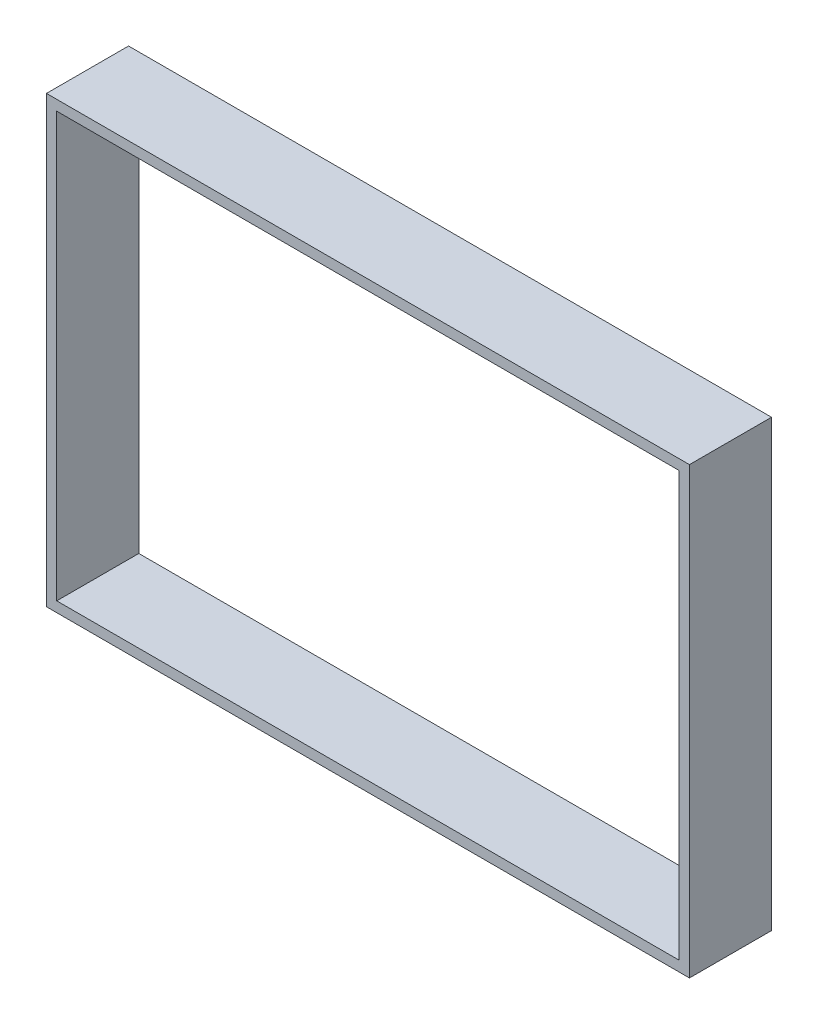
ISO-10303-21;
HEADER;
FILE_DESCRIPTION(('STEP AP214'),'2;1');
FILE_NAME('part.step','',(''),(''),'','','');
FILE_SCHEMA(('AUTOMOTIVE_DESIGN { 1 0 10303 214 1 1 1 1 }'));
ENDSEC;
DATA;
#1=APPLICATION_CONTEXT('core data for automotive mechanical design processes');
#2=APPLICATION_PROTOCOL_DEFINITION('international standard','automotive_design',2000,#1);
#3=PRODUCT_CONTEXT('',#1,'mechanical');
#4=PRODUCT('Part','Part','',(#3));
#5=PRODUCT_RELATED_PRODUCT_CATEGORY('part','',(#4));
#6=PRODUCT_DEFINITION_FORMATION('','',#4);
#7=PRODUCT_DEFINITION_CONTEXT('part definition',#1,'design');
#8=PRODUCT_DEFINITION('design','',#6,#7);
#9=PRODUCT_DEFINITION_SHAPE('','',#8);
#10=(LENGTH_UNIT() NAMED_UNIT(*) SI_UNIT(.MILLI.,.METRE.));
#11=(NAMED_UNIT(*) PLANE_ANGLE_UNIT() SI_UNIT($,.RADIAN.));
#12=(NAMED_UNIT(*) SI_UNIT($,.STERADIAN.) SOLID_ANGLE_UNIT());
#13=UNCERTAINTY_MEASURE_WITH_UNIT(LENGTH_MEASURE(1.E-05),#10,'distance_accuracy_value','');
#14=(GEOMETRIC_REPRESENTATION_CONTEXT(3) GLOBAL_UNCERTAINTY_ASSIGNED_CONTEXT((#13)) GLOBAL_UNIT_ASSIGNED_CONTEXT((#10,
#11,#12)) REPRESENTATION_CONTEXT('',''));
#15=CARTESIAN_POINT('',(0.,0.,0.));
#16=DIRECTION('',(0.,0.,1.));
#17=DIRECTION('',(1.,0.,0.));
#18=AXIS2_PLACEMENT_3D('',#15,#16,#17);
#19=CARTESIAN_POINT('',(0.,0.,12.));
#20=DIRECTION('',(0.,0.,1.));
#21=DIRECTION('',(1.,0.,0.));
#22=AXIS2_PLACEMENT_3D('',#19,#20,#21);
#23=PLANE('',#22);
#24=DIRECTION('',(1.,0.,0.));
#25=VECTOR('',#24,1.);
#26=CARTESIAN_POINT('',(-46.9999999999725,-32.4999999999568,12.));
#27=LINE('',#26,#25);
#28=CARTESIAN_POINT('',(-46.9999999999725,-32.4999999999568,12.));
#29=VERTEX_POINT('',#28);
#30=CARTESIAN_POINT('',(46.9999999999725,-32.4999999999568,12.));
#31=VERTEX_POINT('',#30);
#32=EDGE_CURVE('E134',#29,#31,#27,.T.);
#33=ORIENTED_EDGE('',*,*,#32,.T.);
#34=DIRECTION('',(0.,1.,0.));
#35=VECTOR('',#34,1.);
#36=CARTESIAN_POINT('',(46.9999999999725,-32.4999999999568,12.));
#37=LINE('',#36,#35);
#38=CARTESIAN_POINT('',(46.9999999999725,32.4999999999568,12.));
#39=VERTEX_POINT('',#38);
#40=EDGE_CURVE('E137',#31,#39,#37,.T.);
#41=ORIENTED_EDGE('',*,*,#40,.T.);
#42=DIRECTION('',(-1.,0.,0.));
#43=VECTOR('',#42,1.);
#44=CARTESIAN_POINT('',(46.9999999999725,32.4999999999568,12.));
#45=LINE('',#44,#43);
#46=CARTESIAN_POINT('',(-46.9999999999725,32.4999999999568,12.));
#47=VERTEX_POINT('',#46);
#48=EDGE_CURVE('E140',#39,#47,#45,.T.);
#49=ORIENTED_EDGE('',*,*,#48,.T.);
#50=DIRECTION('',(0.,-1.,0.));
#51=VECTOR('',#50,1.);
#52=CARTESIAN_POINT('',(-46.9999999999725,32.4999999999568,12.));
#53=LINE('',#52,#51);
#54=EDGE_CURVE('E142',#47,#29,#53,.T.);
#55=ORIENTED_EDGE('',*,*,#54,.T.);
#56=EDGE_LOOP('',(#33,#41,#49,#55));
#57=FACE_BOUND('',#56,.T.);
#58=DIRECTION('',(0.,1.,0.));
#59=VECTOR('',#58,1.);
#60=CARTESIAN_POINT('',(45.4999999999725,-30.9999999999568,12.));
#61=LINE('',#60,#59);
#62=CARTESIAN_POINT('',(45.4999999999725,-30.9999999999568,12.));
#63=VERTEX_POINT('',#62);
#64=CARTESIAN_POINT('',(45.4999999999725,30.9999999999568,12.));
#65=VERTEX_POINT('',#64);
#66=EDGE_CURVE('E106',#63,#65,#61,.T.);
#67=ORIENTED_EDGE('',*,*,#66,.F.);
#68=DIRECTION('',(1.,0.,0.));
#69=VECTOR('',#68,1.);
#70=CARTESIAN_POINT('',(-45.4999999999725,-30.9999999999568,12.));
#71=LINE('',#70,#69);
#72=CARTESIAN_POINT('',(-45.4999999999725,-30.9999999999568,12.));
#73=VERTEX_POINT('',#72);
#74=EDGE_CURVE('E98',#73,#63,#71,.T.);
#75=ORIENTED_EDGE('',*,*,#74,.F.);
#76=DIRECTION('',(0.,-1.,0.));
#77=VECTOR('',#76,1.);
#78=CARTESIAN_POINT('',(-45.4999999999725,30.9999999999568,12.));
#79=LINE('',#78,#77);
#80=CARTESIAN_POINT('',(-45.4999999999725,30.9999999999568,12.));
#81=VERTEX_POINT('',#80);
#82=EDGE_CURVE('E120',#81,#73,#79,.T.);
#83=ORIENTED_EDGE('',*,*,#82,.F.);
#84=DIRECTION('',(-1.,0.,0.));
#85=VECTOR('',#84,1.);
#86=CARTESIAN_POINT('',(45.4999999999725,30.9999999999568,12.));
#87=LINE('',#86,#85);
#88=EDGE_CURVE('E118',#65,#81,#87,.T.);
#89=ORIENTED_EDGE('',*,*,#88,.F.);
#90=EDGE_LOOP('',(#67,#75,#83,#89));
#91=FACE_BOUND('',#90,.T.);
#92=ADVANCED_FACE('F33',(#57,#91),#23,.T.);
#93=CARTESIAN_POINT('',(0.,0.,0.));
#94=DIRECTION('',(0.,0.,1.));
#95=DIRECTION('',(1.,0.,0.));
#96=AXIS2_PLACEMENT_3D('',#93,#94,#95);
#97=PLANE('',#96);
#98=DIRECTION('',(1.,0.,0.));
#99=VECTOR('',#98,1.);
#100=CARTESIAN_POINT('',(-46.9999999999725,-32.4999999999568,0.));
#101=LINE('',#100,#99);
#102=CARTESIAN_POINT('',(-46.9999999999725,-32.4999999999568,0.));
#103=VERTEX_POINT('',#102);
#104=CARTESIAN_POINT('',(46.9999999999725,-32.4999999999568,0.));
#105=VERTEX_POINT('',#104);
#106=EDGE_CURVE('E114',#103,#105,#101,.T.);
#107=ORIENTED_EDGE('',*,*,#106,.F.);
#108=DIRECTION('',(0.,-1.,0.));
#109=VECTOR('',#108,1.);
#110=CARTESIAN_POINT('',(-46.9999999999725,32.4999999999568,0.));
#111=LINE('',#110,#109);
#112=CARTESIAN_POINT('',(-46.9999999999725,32.4999999999568,0.));
#113=VERTEX_POINT('',#112);
#114=EDGE_CURVE('E138',#113,#103,#111,.T.);
#115=ORIENTED_EDGE('',*,*,#114,.F.);
#116=DIRECTION('',(-1.,0.,0.));
#117=VECTOR('',#116,1.);
#118=CARTESIAN_POINT('',(46.9999999999725,32.4999999999568,0.));
#119=LINE('',#118,#117);
#120=CARTESIAN_POINT('',(46.9999999999725,32.4999999999568,0.));
#121=VERTEX_POINT('',#120);
#122=EDGE_CURVE('E149',#121,#113,#119,.T.);
#123=ORIENTED_EDGE('',*,*,#122,.F.);
#124=DIRECTION('',(0.,1.,0.));
#125=VECTOR('',#124,1.);
#126=CARTESIAN_POINT('',(46.9999999999725,-32.4999999999568,0.));
#127=LINE('',#126,#125);
#128=EDGE_CURVE('E147',#105,#121,#127,.T.);
#129=ORIENTED_EDGE('',*,*,#128,.F.);
#130=EDGE_LOOP('',(#107,#115,#123,#129));
#131=FACE_BOUND('',#130,.T.);
#132=DIRECTION('',(1.,0.,0.));
#133=VECTOR('',#132,1.);
#134=CARTESIAN_POINT('',(-45.4999999999725,-30.9999999999568,0.));
#135=LINE('',#134,#133);
#136=CARTESIAN_POINT('',(-45.4999999999725,-30.9999999999568,0.));
#137=VERTEX_POINT('',#136);
#138=CARTESIAN_POINT('',(45.4999999999725,-30.9999999999568,0.));
#139=VERTEX_POINT('',#138);
#140=EDGE_CURVE('E56',#137,#139,#135,.T.);
#141=ORIENTED_EDGE('',*,*,#140,.T.);
#142=DIRECTION('',(0.,1.,0.));
#143=VECTOR('',#142,1.);
#144=CARTESIAN_POINT('',(45.4999999999725,-30.9999999999568,0.));
#145=LINE('',#144,#143);
#146=CARTESIAN_POINT('',(45.4999999999725,30.9999999999568,0.));
#147=VERTEX_POINT('',#146);
#148=EDGE_CURVE('E113',#139,#147,#145,.T.);
#149=ORIENTED_EDGE('',*,*,#148,.T.);
#150=DIRECTION('',(-1.,0.,0.));
#151=VECTOR('',#150,1.);
#152=CARTESIAN_POINT('',(45.4999999999725,30.9999999999568,0.));
#153=LINE('',#152,#151);
#154=CARTESIAN_POINT('',(-45.4999999999725,30.9999999999568,0.));
#155=VERTEX_POINT('',#154);
#156=EDGE_CURVE('E126',#147,#155,#153,.T.);
#157=ORIENTED_EDGE('',*,*,#156,.T.);
#158=DIRECTION('',(0.,-1.,0.));
#159=VECTOR('',#158,1.);
#160=CARTESIAN_POINT('',(-45.4999999999725,30.9999999999568,0.));
#161=LINE('',#160,#159);
#162=EDGE_CURVE('E107',#155,#137,#161,.T.);
#163=ORIENTED_EDGE('',*,*,#162,.T.);
#164=EDGE_LOOP('',(#141,#149,#157,#163));
#165=FACE_BOUND('',#164,.T.);
#166=ADVANCED_FACE('F167',(#131,#165),#97,.F.);
#167=CARTESIAN_POINT('',(-46.9999999999725,-32.4999999999568,12.));
#168=DIRECTION('',(0.,1.,0.));
#169=DIRECTION('',(0.,0.,1.));
#170=AXIS2_PLACEMENT_3D('',#167,#168,#169);
#171=PLANE('',#170);
#172=ORIENTED_EDGE('',*,*,#106,.T.);
#173=DIRECTION('',(0.,0.,-1.));
#174=VECTOR('',#173,1.);
#175=CARTESIAN_POINT('',(46.9999999999725,-32.4999999999568,12.));
#176=LINE('',#175,#174);
#177=EDGE_CURVE('E11',#31,#105,#176,.T.);
#178=ORIENTED_EDGE('',*,*,#177,.F.);
#179=ORIENTED_EDGE('',*,*,#32,.F.);
#180=DIRECTION('',(0.,0.,-1.));
#181=VECTOR('',#180,1.);
#182=CARTESIAN_POINT('',(-46.9999999999725,-32.4999999999568,12.));
#183=LINE('',#182,#181);
#184=EDGE_CURVE('E144',#29,#103,#183,.T.);
#185=ORIENTED_EDGE('',*,*,#184,.T.);
#186=EDGE_LOOP('',(#172,#178,#179,#185));
#187=FACE_BOUND('',#186,.T.);
#188=ADVANCED_FACE('F35',(#187),#171,.F.);
#189=CARTESIAN_POINT('',(46.9999999999725,-32.4999999999568,12.));
#190=DIRECTION('',(-1.,0.,0.));
#191=DIRECTION('',(0.,0.,1.));
#192=AXIS2_PLACEMENT_3D('',#189,#190,#191);
#193=PLANE('',#192);
#194=ORIENTED_EDGE('',*,*,#128,.T.);
#195=DIRECTION('',(0.,0.,-1.));
#196=VECTOR('',#195,1.);
#197=CARTESIAN_POINT('',(46.9999999999725,32.4999999999568,12.));
#198=LINE('',#197,#196);
#199=EDGE_CURVE('E41',#39,#121,#198,.T.);
#200=ORIENTED_EDGE('',*,*,#199,.F.);
#201=ORIENTED_EDGE('',*,*,#40,.F.);
#202=ORIENTED_EDGE('',*,*,#177,.T.);
#203=EDGE_LOOP('',(#194,#200,#201,#202));
#204=FACE_BOUND('',#203,.T.);
#205=ADVANCED_FACE('F177',(#204),#193,.F.);
#206=CARTESIAN_POINT('',(46.9999999999725,32.4999999999568,12.));
#207=DIRECTION('',(0.,-1.,0.));
#208=DIRECTION('',(0.,0.,-1.));
#209=AXIS2_PLACEMENT_3D('',#206,#207,#208);
#210=PLANE('',#209);
#211=ORIENTED_EDGE('',*,*,#122,.T.);
#212=DIRECTION('',(0.,0.,-1.));
#213=VECTOR('',#212,1.);
#214=CARTESIAN_POINT('',(-46.9999999999725,32.4999999999568,12.));
#215=LINE('',#214,#213);
#216=EDGE_CURVE('E154',#47,#113,#215,.T.);
#217=ORIENTED_EDGE('',*,*,#216,.F.);
#218=ORIENTED_EDGE('',*,*,#48,.F.);
#219=ORIENTED_EDGE('',*,*,#199,.T.);
#220=EDGE_LOOP('',(#211,#217,#218,#219));
#221=FACE_BOUND('',#220,.T.);
#222=ADVANCED_FACE('F161',(#221),#210,.F.);
#223=CARTESIAN_POINT('',(-46.9999999999725,32.4999999999568,12.));
#224=DIRECTION('',(1.,0.,0.));
#225=DIRECTION('',(0.,0.,-1.));
#226=AXIS2_PLACEMENT_3D('',#223,#224,#225);
#227=PLANE('',#226);
#228=ORIENTED_EDGE('',*,*,#114,.T.);
#229=ORIENTED_EDGE('',*,*,#184,.F.);
#230=ORIENTED_EDGE('',*,*,#54,.F.);
#231=ORIENTED_EDGE('',*,*,#216,.T.);
#232=EDGE_LOOP('',(#228,#229,#230,#231));
#233=FACE_BOUND('',#232,.T.);
#234=ADVANCED_FACE('F171',(#233),#227,.F.);
#235=CARTESIAN_POINT('',(-45.4999999999725,-30.9999999999568,12.));
#236=DIRECTION('',(0.,1.,0.));
#237=DIRECTION('',(0.,0.,1.));
#238=AXIS2_PLACEMENT_3D('',#235,#236,#237);
#239=PLANE('',#238);
#240=ORIENTED_EDGE('',*,*,#140,.F.);
#241=DIRECTION('',(0.,0.,-1.));
#242=VECTOR('',#241,1.);
#243=CARTESIAN_POINT('',(-45.4999999999725,-30.9999999999568,12.));
#244=LINE('',#243,#242);
#245=EDGE_CURVE('E102',#73,#137,#244,.T.);
#246=ORIENTED_EDGE('',*,*,#245,.F.);
#247=ORIENTED_EDGE('',*,*,#74,.T.);
#248=DIRECTION('',(0.,0.,-1.));
#249=VECTOR('',#248,1.);
#250=CARTESIAN_POINT('',(45.4999999999725,-30.9999999999568,12.));
#251=LINE('',#250,#249);
#252=EDGE_CURVE('E101',#63,#139,#251,.T.);
#253=ORIENTED_EDGE('',*,*,#252,.T.);
#254=EDGE_LOOP('',(#240,#246,#247,#253));
#255=FACE_BOUND('',#254,.T.);
#256=ADVANCED_FACE('F100',(#255),#239,.T.);
#257=CARTESIAN_POINT('',(45.4999999999725,-30.9999999999568,12.));
#258=DIRECTION('',(-1.,0.,0.));
#259=DIRECTION('',(0.,0.,1.));
#260=AXIS2_PLACEMENT_3D('',#257,#258,#259);
#261=PLANE('',#260);
#262=ORIENTED_EDGE('',*,*,#148,.F.);
#263=ORIENTED_EDGE('',*,*,#252,.F.);
#264=ORIENTED_EDGE('',*,*,#66,.T.);
#265=DIRECTION('',(0.,0.,-1.));
#266=VECTOR('',#265,1.);
#267=CARTESIAN_POINT('',(45.4999999999725,30.9999999999568,12.));
#268=LINE('',#267,#266);
#269=EDGE_CURVE('E115',#65,#147,#268,.T.);
#270=ORIENTED_EDGE('',*,*,#269,.T.);
#271=EDGE_LOOP('',(#262,#263,#264,#270));
#272=FACE_BOUND('',#271,.T.);
#273=ADVANCED_FACE('F110',(#272),#261,.T.);
#274=CARTESIAN_POINT('',(45.4999999999725,30.9999999999568,12.));
#275=DIRECTION('',(0.,-1.,0.));
#276=DIRECTION('',(0.,0.,-1.));
#277=AXIS2_PLACEMENT_3D('',#274,#275,#276);
#278=PLANE('',#277);
#279=ORIENTED_EDGE('',*,*,#156,.F.);
#280=ORIENTED_EDGE('',*,*,#269,.F.);
#281=ORIENTED_EDGE('',*,*,#88,.T.);
#282=DIRECTION('',(0.,0.,-1.));
#283=VECTOR('',#282,1.);
#284=CARTESIAN_POINT('',(-45.4999999999725,30.9999999999568,12.));
#285=LINE('',#284,#283);
#286=EDGE_CURVE('E48',#81,#155,#285,.T.);
#287=ORIENTED_EDGE('',*,*,#286,.T.);
#288=EDGE_LOOP('',(#279,#280,#281,#287));
#289=FACE_BOUND('',#288,.T.);
#290=ADVANCED_FACE('F200',(#289),#278,.T.);
#291=CARTESIAN_POINT('',(-45.4999999999725,30.9999999999568,12.));
#292=DIRECTION('',(1.,0.,0.));
#293=DIRECTION('',(0.,0.,-1.));
#294=AXIS2_PLACEMENT_3D('',#291,#292,#293);
#295=PLANE('',#294);
#296=ORIENTED_EDGE('',*,*,#162,.F.);
#297=ORIENTED_EDGE('',*,*,#286,.F.);
#298=ORIENTED_EDGE('',*,*,#82,.T.);
#299=ORIENTED_EDGE('',*,*,#245,.T.);
#300=EDGE_LOOP('',(#296,#297,#298,#299));
#301=FACE_BOUND('',#300,.T.);
#302=ADVANCED_FACE('F204',(#301),#295,.T.);
#303=CLOSED_SHELL('',(#92,#166,#188,#205,#222,#234,#256,#273,#290,#302));
#304=MANIFOLD_SOLID_BREP('B2',#303);
#305=ADVANCED_BREP_SHAPE_REPRESENTATION('',(#18,#304),#14);
#306=SHAPE_DEFINITION_REPRESENTATION(#9,#305);
ENDSEC;
END-ISO-10303-21;
